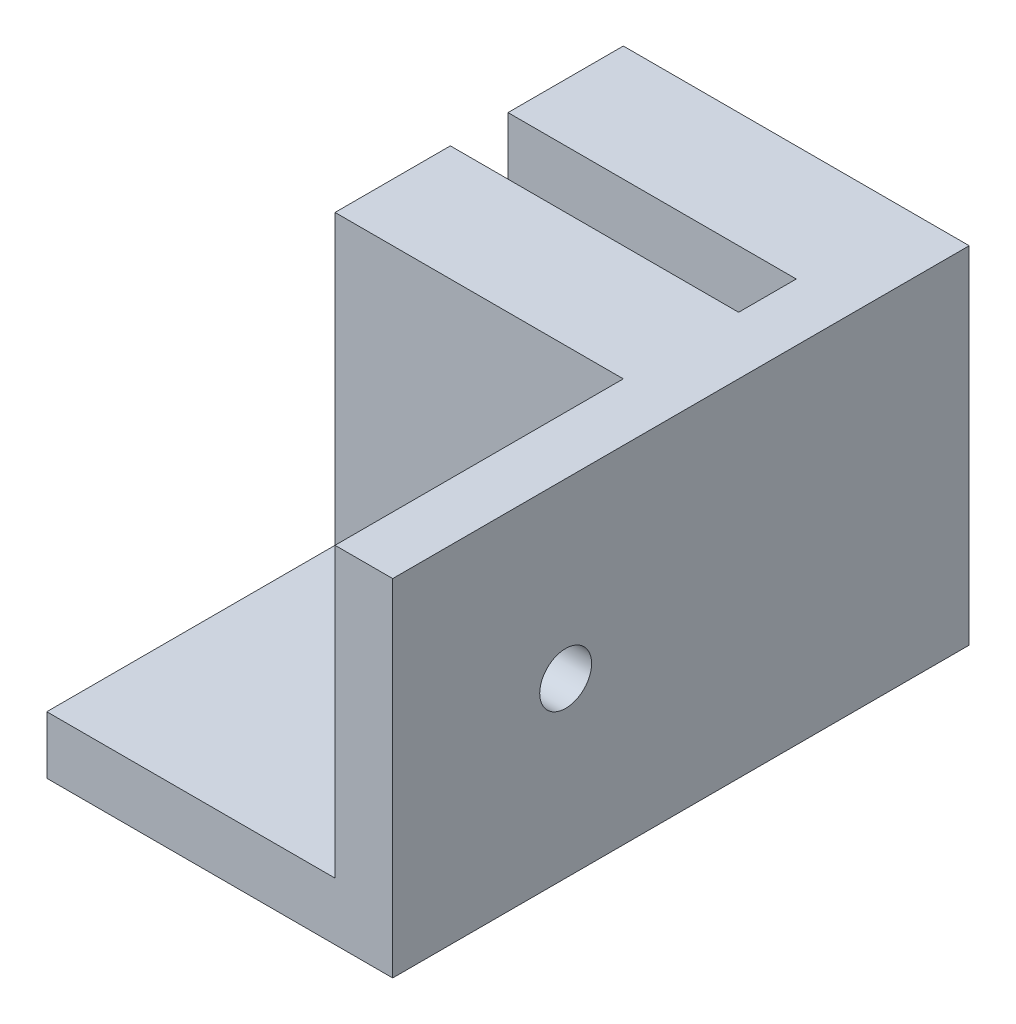
ISO-10303-21;
HEADER;
FILE_DESCRIPTION(('STEP AP214'),'2;1');
FILE_NAME('part.step','',(''),(''),'','','');
FILE_SCHEMA(('AUTOMOTIVE_DESIGN { 1 0 10303 214 1 1 1 1 }'));
ENDSEC;
DATA;
#1=APPLICATION_CONTEXT('core data for automotive mechanical design processes');
#2=APPLICATION_PROTOCOL_DEFINITION('international standard','automotive_design',2000,#1);
#3=PRODUCT_CONTEXT('',#1,'mechanical');
#4=PRODUCT('Part','Part','',(#3));
#5=PRODUCT_RELATED_PRODUCT_CATEGORY('part','',(#4));
#6=PRODUCT_DEFINITION_FORMATION('','',#4);
#7=PRODUCT_DEFINITION_CONTEXT('part definition',#1,'design');
#8=PRODUCT_DEFINITION('design','',#6,#7);
#9=PRODUCT_DEFINITION_SHAPE('','',#8);
#10=(LENGTH_UNIT() NAMED_UNIT(*) SI_UNIT(.MILLI.,.METRE.));
#11=(NAMED_UNIT(*) PLANE_ANGLE_UNIT() SI_UNIT($,.RADIAN.));
#12=(NAMED_UNIT(*) SI_UNIT($,.STERADIAN.) SOLID_ANGLE_UNIT());
#13=UNCERTAINTY_MEASURE_WITH_UNIT(LENGTH_MEASURE(1.E-05),#10,'distance_accuracy_value','');
#14=(GEOMETRIC_REPRESENTATION_CONTEXT(3) GLOBAL_UNCERTAINTY_ASSIGNED_CONTEXT((#13)) GLOBAL_UNIT_ASSIGNED_CONTEXT((#10,
#11,#12)) REPRESENTATION_CONTEXT('',''));
#15=CARTESIAN_POINT('',(0.,0.,0.));
#16=DIRECTION('',(0.,0.,1.));
#17=DIRECTION('',(1.,0.,0.));
#18=AXIS2_PLACEMENT_3D('',#15,#16,#17);
#19=CARTESIAN_POINT('',(-30.,0.,50.));
#20=DIRECTION('',(1.,0.,0.));
#21=DIRECTION('',(0.,0.,-1.));
#22=AXIS2_PLACEMENT_3D('',#19,#20,#21);
#23=PLANE('',#22);
#24=DIRECTION('',(0.,0.,-1.));
#25=VECTOR('',#24,1.);
#26=CARTESIAN_POINT('',(-30.,0.,50.));
#27=LINE('',#26,#25);
#28=CARTESIAN_POINT('',(-30.,0.,10.));
#29=VERTEX_POINT('',#28);
#30=CARTESIAN_POINT('',(-30.,0.,0.));
#31=VERTEX_POINT('',#30);
#32=EDGE_CURVE('E202',#29,#31,#27,.T.);
#33=ORIENTED_EDGE('',*,*,#32,.F.);
#34=DIRECTION('',(0.,1.,0.));
#35=VECTOR('',#34,1.);
#36=CARTESIAN_POINT('',(-30.,0.,10.));
#37=LINE('',#36,#35);
#38=CARTESIAN_POINT('',(-30.,30.,10.));
#39=VERTEX_POINT('',#38);
#40=EDGE_CURVE('E169',#29,#39,#37,.T.);
#41=ORIENTED_EDGE('',*,*,#40,.T.);
#42=DIRECTION('',(0.,0.,-1.));
#43=VECTOR('',#42,1.);
#44=CARTESIAN_POINT('',(-30.,30.,50.));
#45=LINE('',#44,#43);
#46=CARTESIAN_POINT('',(-30.,30.,0.));
#47=VERTEX_POINT('',#46);
#48=EDGE_CURVE('E205',#39,#47,#45,.T.);
#49=ORIENTED_EDGE('',*,*,#48,.T.);
#50=DIRECTION('',(0.,-1.,0.));
#51=VECTOR('',#50,1.);
#52=CARTESIAN_POINT('',(-30.,0.,0.));
#53=LINE('',#52,#51);
#54=EDGE_CURVE('E196',#47,#31,#53,.T.);
#55=ORIENTED_EDGE('',*,*,#54,.T.);
#56=EDGE_LOOP('',(#33,#41,#49,#55));
#57=FACE_BOUND('',#56,.T.);
#58=ADVANCED_FACE('F38',(#57),#23,.F.);
#59=CARTESIAN_POINT('',(0.,0.,50.));
#60=DIRECTION('',(-1.,0.,0.));
#61=DIRECTION('',(0.,0.,1.));
#62=AXIS2_PLACEMENT_3D('',#59,#60,#61);
#63=PLANE('',#62);
#64=CARTESIAN_POINT('',(0.,15.,35.));
#65=DIRECTION('',(-1.,0.,0.));
#66=DIRECTION('',(0.,0.,1.));
#67=AXIS2_PLACEMENT_3D('',#64,#65,#66);
#68=CIRCLE('',#67,2.25);
#69=CARTESIAN_POINT('',(0.,15.,37.25));
#70=VERTEX_POINT('',#69);
#71=EDGE_CURVE('E144',#70,#70,#68,.T.);
#72=ORIENTED_EDGE('',*,*,#71,.T.);
#73=EDGE_LOOP('',(#72));
#74=FACE_BOUND('',#73,.T.);
#75=DIRECTION('',(0.,1.,0.));
#76=VECTOR('',#75,1.);
#77=CARTESIAN_POINT('',(0.,0.,0.));
#78=LINE('',#77,#76);
#79=CARTESIAN_POINT('',(0.,0.,0.));
#80=VERTEX_POINT('',#79);
#81=CARTESIAN_POINT('',(0.,30.,0.));
#82=VERTEX_POINT('',#81);
#83=EDGE_CURVE('E172',#80,#82,#78,.T.);
#84=ORIENTED_EDGE('',*,*,#83,.T.);
#85=DIRECTION('',(0.,0.,-1.));
#86=VECTOR('',#85,1.);
#87=CARTESIAN_POINT('',(0.,30.,50.));
#88=LINE('',#87,#86);
#89=CARTESIAN_POINT('',(0.,30.,50.));
#90=VERTEX_POINT('',#89);
#91=EDGE_CURVE('E11',#90,#82,#88,.T.);
#92=ORIENTED_EDGE('',*,*,#91,.F.);
#93=DIRECTION('',(0.,1.,0.));
#94=VECTOR('',#93,1.);
#95=CARTESIAN_POINT('',(0.,0.,50.));
#96=LINE('',#95,#94);
#97=CARTESIAN_POINT('',(0.,0.,50.));
#98=VERTEX_POINT('',#97);
#99=EDGE_CURVE('E179',#98,#90,#96,.T.);
#100=ORIENTED_EDGE('',*,*,#99,.F.);
#101=DIRECTION('',(0.,0.,-1.));
#102=VECTOR('',#101,1.);
#103=CARTESIAN_POINT('',(0.,0.,50.));
#104=LINE('',#103,#102);
#105=EDGE_CURVE('E190',#98,#80,#104,.T.);
#106=ORIENTED_EDGE('',*,*,#105,.T.);
#107=EDGE_LOOP('',(#84,#92,#100,#106));
#108=FACE_BOUND('',#107,.T.);
#109=ADVANCED_FACE('F40',(#74,#108),#63,.F.);
#110=CARTESIAN_POINT('',(0.,30.,50.));
#111=DIRECTION('',(0.,-1.,0.));
#112=DIRECTION('',(1.,0.,0.));
#113=AXIS2_PLACEMENT_3D('',#110,#111,#112);
#114=PLANE('',#113);
#115=DIRECTION('',(-1.,0.,0.));
#116=VECTOR('',#115,1.);
#117=CARTESIAN_POINT('',(-5.,30.,25.));
#118=LINE('',#117,#116);
#119=CARTESIAN_POINT('',(-5.,30.,25.));
#120=VERTEX_POINT('',#119);
#121=CARTESIAN_POINT('',(-30.,30.,25.));
#122=VERTEX_POINT('',#121);
#123=EDGE_CURVE('E140',#120,#122,#118,.T.);
#124=ORIENTED_EDGE('',*,*,#123,.F.);
#125=DIRECTION('',(0.,0.,-1.));
#126=VECTOR('',#125,1.);
#127=CARTESIAN_POINT('',(-5.,30.,25.));
#128=LINE('',#127,#126);
#129=CARTESIAN_POINT('',(-5.,30.,50.));
#130=VERTEX_POINT('',#129);
#131=EDGE_CURVE('E128',#130,#120,#128,.T.);
#132=ORIENTED_EDGE('',*,*,#131,.F.);
#133=DIRECTION('',(-1.,0.,0.));
#134=VECTOR('',#133,1.);
#135=CARTESIAN_POINT('',(0.,30.,50.));
#136=LINE('',#135,#134);
#137=EDGE_CURVE('E182',#90,#130,#136,.T.);
#138=ORIENTED_EDGE('',*,*,#137,.F.);
#139=ORIENTED_EDGE('',*,*,#91,.T.);
#140=DIRECTION('',(-1.,0.,0.));
#141=VECTOR('',#140,1.);
#142=CARTESIAN_POINT('',(0.,30.,0.));
#143=LINE('',#142,#141);
#144=EDGE_CURVE('E193',#82,#47,#143,.T.);
#145=ORIENTED_EDGE('',*,*,#144,.T.);
#146=ORIENTED_EDGE('',*,*,#48,.F.);
#147=DIRECTION('',(-1.,0.,0.));
#148=VECTOR('',#147,1.);
#149=CARTESIAN_POINT('',(-30.,30.,10.));
#150=LINE('',#149,#148);
#151=CARTESIAN_POINT('',(-5.,30.,10.));
#152=VERTEX_POINT('',#151);
#153=EDGE_CURVE('E157',#152,#39,#150,.T.);
#154=ORIENTED_EDGE('',*,*,#153,.F.);
#155=DIRECTION('',(0.,0.,-1.));
#156=VECTOR('',#155,1.);
#157=CARTESIAN_POINT('',(-5.,30.,10.));
#158=LINE('',#157,#156);
#159=CARTESIAN_POINT('',(-5.,30.,15.));
#160=VERTEX_POINT('',#159);
#161=EDGE_CURVE('E165',#160,#152,#158,.T.);
#162=ORIENTED_EDGE('',*,*,#161,.F.);
#163=DIRECTION('',(1.,0.,0.));
#164=VECTOR('',#163,1.);
#165=CARTESIAN_POINT('',(-30.,30.,15.));
#166=LINE('',#165,#164);
#167=CARTESIAN_POINT('',(-30.,30.,15.));
#168=VERTEX_POINT('',#167);
#169=EDGE_CURVE('E152',#168,#160,#166,.T.);
#170=ORIENTED_EDGE('',*,*,#169,.F.);
#171=EDGE_CURVE('E46',#122,#168,#45,.T.);
#172=ORIENTED_EDGE('',*,*,#171,.F.);
#173=EDGE_LOOP('',(#124,#132,#138,#139,#145,#146,#154,#162,#170,#172));
#174=FACE_BOUND('',#173,.T.);
#175=ADVANCED_FACE('F216',(#174),#114,.F.);
#176=DIRECTION('',(0.,0.,1.));
#177=VECTOR('',#176,1.);
#178=CARTESIAN_POINT('',(-30.,5.,25.));
#179=LINE('',#178,#177);
#180=CARTESIAN_POINT('',(-30.,5.,25.));
#181=VERTEX_POINT('',#180);
#182=CARTESIAN_POINT('',(-30.,5.,50.));
#183=VERTEX_POINT('',#182);
#184=EDGE_CURVE('E53',#181,#183,#179,.T.);
#185=ORIENTED_EDGE('',*,*,#184,.F.);
#186=DIRECTION('',(0.,1.,0.));
#187=VECTOR('',#186,1.);
#188=CARTESIAN_POINT('',(-30.,5.,25.));
#189=LINE('',#188,#187);
#190=EDGE_CURVE('E131',#181,#122,#189,.T.);
#191=ORIENTED_EDGE('',*,*,#190,.T.);
#192=ORIENTED_EDGE('',*,*,#171,.T.);
#193=DIRECTION('',(0.,1.,0.));
#194=VECTOR('',#193,1.);
#195=CARTESIAN_POINT('',(-30.,0.,15.));
#196=LINE('',#195,#194);
#197=CARTESIAN_POINT('',(-30.,0.,15.));
#198=VERTEX_POINT('',#197);
#199=EDGE_CURVE('E162',#198,#168,#196,.T.);
#200=ORIENTED_EDGE('',*,*,#199,.F.);
#201=CARTESIAN_POINT('',(-30.,0.,50.));
#202=VERTEX_POINT('',#201);
#203=EDGE_CURVE('E203',#202,#198,#27,.T.);
#204=ORIENTED_EDGE('',*,*,#203,.F.);
#205=DIRECTION('',(0.,-1.,0.));
#206=VECTOR('',#205,1.);
#207=CARTESIAN_POINT('',(-30.,0.,50.));
#208=LINE('',#207,#206);
#209=EDGE_CURVE('E186',#183,#202,#208,.T.);
#210=ORIENTED_EDGE('',*,*,#209,.F.);
#211=EDGE_LOOP('',(#185,#191,#192,#200,#204,#210));
#212=FACE_BOUND('',#211,.T.);
#213=ADVANCED_FACE('F231',(#212),#23,.F.);
#214=CARTESIAN_POINT('',(0.,0.,50.));
#215=DIRECTION('',(0.,1.,0.));
#216=DIRECTION('',(-1.,0.,0.));
#217=AXIS2_PLACEMENT_3D('',#214,#215,#216);
#218=PLANE('',#217);
#219=CARTESIAN_POINT('',(-15.,0.,35.));
#220=DIRECTION('',(0.,1.,0.));
#221=DIRECTION('',(0.,0.,1.));
#222=AXIS2_PLACEMENT_3D('',#219,#220,#221);
#223=CIRCLE('',#222,2.25);
#224=CARTESIAN_POINT('',(-15.,0.,37.25));
#225=VERTEX_POINT('',#224);
#226=EDGE_CURVE('E398',#225,#225,#223,.T.);
#227=ORIENTED_EDGE('',*,*,#226,.T.);
#228=EDGE_LOOP('',(#227));
#229=FACE_BOUND('',#228,.T.);
#230=DIRECTION('',(0.,0.,-1.));
#231=VECTOR('',#230,1.);
#232=CARTESIAN_POINT('',(-5.,0.,10.));
#233=LINE('',#232,#231);
#234=CARTESIAN_POINT('',(-5.,0.,15.));
#235=VERTEX_POINT('',#234);
#236=CARTESIAN_POINT('',(-5.,0.,10.));
#237=VERTEX_POINT('',#236);
#238=EDGE_CURVE('E61',#235,#237,#233,.T.);
#239=ORIENTED_EDGE('',*,*,#238,.T.);
#240=DIRECTION('',(-1.,0.,0.));
#241=VECTOR('',#240,1.);
#242=CARTESIAN_POINT('',(-30.,0.,10.));
#243=LINE('',#242,#241);
#244=EDGE_CURVE('E159',#237,#29,#243,.T.);
#245=ORIENTED_EDGE('',*,*,#244,.T.);
#246=ORIENTED_EDGE('',*,*,#32,.T.);
#247=DIRECTION('',(1.,0.,0.));
#248=VECTOR('',#247,1.);
#249=CARTESIAN_POINT('',(0.,0.,0.));
#250=LINE('',#249,#248);
#251=EDGE_CURVE('E183',#31,#80,#250,.T.);
#252=ORIENTED_EDGE('',*,*,#251,.T.);
#253=ORIENTED_EDGE('',*,*,#105,.F.);
#254=DIRECTION('',(1.,0.,0.));
#255=VECTOR('',#254,1.);
#256=CARTESIAN_POINT('',(0.,0.,50.));
#257=LINE('',#256,#255);
#258=EDGE_CURVE('E188',#202,#98,#257,.T.);
#259=ORIENTED_EDGE('',*,*,#258,.F.);
#260=ORIENTED_EDGE('',*,*,#203,.T.);
#261=DIRECTION('',(1.,0.,0.));
#262=VECTOR('',#261,1.);
#263=CARTESIAN_POINT('',(-30.,0.,15.));
#264=LINE('',#263,#262);
#265=EDGE_CURVE('E154',#198,#235,#264,.T.);
#266=ORIENTED_EDGE('',*,*,#265,.T.);
#267=EDGE_LOOP('',(#239,#245,#246,#252,#253,#259,#260,#266));
#268=FACE_BOUND('',#267,.T.);
#269=ADVANCED_FACE('F223',(#229,#268),#218,.F.);
#270=CARTESIAN_POINT('',(0.,0.,50.));
#271=DIRECTION('',(0.,0.,1.));
#272=DIRECTION('',(1.,0.,0.));
#273=AXIS2_PLACEMENT_3D('',#270,#271,#272);
#274=PLANE('',#273);
#275=DIRECTION('',(0.,1.,0.));
#276=VECTOR('',#275,1.);
#277=CARTESIAN_POINT('',(-5.,5.,50.));
#278=LINE('',#277,#276);
#279=CARTESIAN_POINT('',(-5.,5.,50.));
#280=VERTEX_POINT('',#279);
#281=EDGE_CURVE('E150',#280,#130,#278,.T.);
#282=ORIENTED_EDGE('',*,*,#281,.F.);
#283=DIRECTION('',(1.,0.,0.));
#284=VECTOR('',#283,1.);
#285=CARTESIAN_POINT('',(-5.,5.,50.));
#286=LINE('',#285,#284);
#287=EDGE_CURVE('E132',#183,#280,#286,.T.);
#288=ORIENTED_EDGE('',*,*,#287,.F.);
#289=ORIENTED_EDGE('',*,*,#209,.T.);
#290=ORIENTED_EDGE('',*,*,#258,.T.);
#291=ORIENTED_EDGE('',*,*,#99,.T.);
#292=ORIENTED_EDGE('',*,*,#137,.T.);
#293=EDGE_LOOP('',(#282,#288,#289,#290,#291,#292));
#294=FACE_BOUND('',#293,.T.);
#295=ADVANCED_FACE('F228',(#294),#274,.T.);
#296=CARTESIAN_POINT('',(0.,0.,0.));
#297=DIRECTION('',(0.,0.,1.));
#298=DIRECTION('',(1.,0.,0.));
#299=AXIS2_PLACEMENT_3D('',#296,#297,#298);
#300=PLANE('',#299);
#301=ORIENTED_EDGE('',*,*,#83,.F.);
#302=ORIENTED_EDGE('',*,*,#251,.F.);
#303=ORIENTED_EDGE('',*,*,#54,.F.);
#304=ORIENTED_EDGE('',*,*,#144,.F.);
#305=EDGE_LOOP('',(#301,#302,#303,#304));
#306=FACE_BOUND('',#305,.T.);
#307=ADVANCED_FACE('F220',(#306),#300,.F.);
#308=CARTESIAN_POINT('',(-30.,0.,10.));
#309=DIRECTION('',(0.,0.,-1.));
#310=DIRECTION('',(-1.,0.,0.));
#311=AXIS2_PLACEMENT_3D('',#308,#309,#310);
#312=PLANE('',#311);
#313=ORIENTED_EDGE('',*,*,#153,.T.);
#314=ORIENTED_EDGE('',*,*,#40,.F.);
#315=ORIENTED_EDGE('',*,*,#244,.F.);
#316=DIRECTION('',(0.,1.,0.));
#317=VECTOR('',#316,1.);
#318=CARTESIAN_POINT('',(-5.,0.,10.));
#319=LINE('',#318,#317);
#320=EDGE_CURVE('E173',#237,#152,#319,.T.);
#321=ORIENTED_EDGE('',*,*,#320,.T.);
#322=EDGE_LOOP('',(#313,#314,#315,#321));
#323=FACE_BOUND('',#322,.T.);
#324=ADVANCED_FACE('F239',(#323),#312,.F.);
#325=CARTESIAN_POINT('',(-5.,0.,10.));
#326=DIRECTION('',(1.,0.,0.));
#327=DIRECTION('',(0.,0.,-1.));
#328=AXIS2_PLACEMENT_3D('',#325,#326,#327);
#329=PLANE('',#328);
#330=ORIENTED_EDGE('',*,*,#161,.T.);
#331=ORIENTED_EDGE('',*,*,#320,.F.);
#332=ORIENTED_EDGE('',*,*,#238,.F.);
#333=DIRECTION('',(0.,1.,0.));
#334=VECTOR('',#333,1.);
#335=CARTESIAN_POINT('',(-5.,0.,15.));
#336=LINE('',#335,#334);
#337=EDGE_CURVE('E175',#235,#160,#336,.T.);
#338=ORIENTED_EDGE('',*,*,#337,.T.);
#339=EDGE_LOOP('',(#330,#331,#332,#338));
#340=FACE_BOUND('',#339,.T.);
#341=ADVANCED_FACE('F236',(#340),#329,.F.);
#342=CARTESIAN_POINT('',(-30.,0.,15.));
#343=DIRECTION('',(0.,0.,1.));
#344=DIRECTION('',(1.,0.,0.));
#345=AXIS2_PLACEMENT_3D('',#342,#343,#344);
#346=PLANE('',#345);
#347=ORIENTED_EDGE('',*,*,#169,.T.);
#348=ORIENTED_EDGE('',*,*,#337,.F.);
#349=ORIENTED_EDGE('',*,*,#265,.F.);
#350=ORIENTED_EDGE('',*,*,#199,.T.);
#351=EDGE_LOOP('',(#347,#348,#349,#350));
#352=FACE_BOUND('',#351,.T.);
#353=ADVANCED_FACE('F234',(#352),#346,.F.);
#354=CARTESIAN_POINT('',(-5.,5.,25.));
#355=DIRECTION('',(1.,0.,0.));
#356=DIRECTION('',(0.,0.,-1.));
#357=AXIS2_PLACEMENT_3D('',#354,#355,#356);
#358=PLANE('',#357);
#359=CARTESIAN_POINT('',(-5.,15.,35.));
#360=DIRECTION('',(-1.,0.,0.));
#361=DIRECTION('',(0.,0.,1.));
#362=AXIS2_PLACEMENT_3D('',#359,#360,#361);
#363=CIRCLE('',#362,2.24999999999999);
#364=CARTESIAN_POINT('',(-5.,15.,37.25));
#365=VERTEX_POINT('',#364);
#366=EDGE_CURVE('E403',#365,#365,#363,.T.);
#367=ORIENTED_EDGE('',*,*,#366,.F.);
#368=EDGE_LOOP('',(#367));
#369=FACE_BOUND('',#368,.T.);
#370=ORIENTED_EDGE('',*,*,#131,.T.);
#371=DIRECTION('',(0.,1.,0.));
#372=VECTOR('',#371,1.);
#373=CARTESIAN_POINT('',(-5.,5.,25.));
#374=LINE('',#373,#372);
#375=CARTESIAN_POINT('',(-5.,5.,25.));
#376=VERTEX_POINT('',#375);
#377=EDGE_CURVE('E122',#376,#120,#374,.T.);
#378=ORIENTED_EDGE('',*,*,#377,.F.);
#379=DIRECTION('',(0.,0.,-1.));
#380=VECTOR('',#379,1.);
#381=CARTESIAN_POINT('',(-5.,5.,25.));
#382=LINE('',#381,#380);
#383=EDGE_CURVE('E126',#280,#376,#382,.T.);
#384=ORIENTED_EDGE('',*,*,#383,.F.);
#385=ORIENTED_EDGE('',*,*,#281,.T.);
#386=EDGE_LOOP('',(#370,#378,#384,#385));
#387=FACE_BOUND('',#386,.T.);
#388=ADVANCED_FACE('F124',(#369,#387),#358,.F.);
#389=CARTESIAN_POINT('',(-5.,5.,25.));
#390=DIRECTION('',(0.,0.,-1.));
#391=DIRECTION('',(-1.,0.,0.));
#392=AXIS2_PLACEMENT_3D('',#389,#390,#391);
#393=PLANE('',#392);
#394=ORIENTED_EDGE('',*,*,#123,.T.);
#395=ORIENTED_EDGE('',*,*,#190,.F.);
#396=DIRECTION('',(-1.,0.,0.));
#397=VECTOR('',#396,1.);
#398=CARTESIAN_POINT('',(-5.,5.,25.));
#399=LINE('',#398,#397);
#400=EDGE_CURVE('E134',#376,#181,#399,.T.);
#401=ORIENTED_EDGE('',*,*,#400,.F.);
#402=ORIENTED_EDGE('',*,*,#377,.T.);
#403=EDGE_LOOP('',(#394,#395,#401,#402));
#404=FACE_BOUND('',#403,.T.);
#405=ADVANCED_FACE('F135',(#404),#393,.F.);
#406=CARTESIAN_POINT('',(0.,5.,0.));
#407=DIRECTION('',(0.,-1.,0.));
#408=DIRECTION('',(0.,0.,-1.));
#409=AXIS2_PLACEMENT_3D('',#406,#407,#408);
#410=PLANE('',#409);
#411=CARTESIAN_POINT('',(-15.,5.,35.));
#412=DIRECTION('',(0.,1.,0.));
#413=DIRECTION('',(0.,0.,1.));
#414=AXIS2_PLACEMENT_3D('',#411,#412,#413);
#415=CIRCLE('',#414,2.24999999999999);
#416=CARTESIAN_POINT('',(-15.,5.,37.25));
#417=VERTEX_POINT('',#416);
#418=EDGE_CURVE('E401',#417,#417,#415,.T.);
#419=ORIENTED_EDGE('',*,*,#418,.F.);
#420=EDGE_LOOP('',(#419));
#421=FACE_BOUND('',#420,.T.);
#422=ORIENTED_EDGE('',*,*,#383,.T.);
#423=ORIENTED_EDGE('',*,*,#400,.T.);
#424=ORIENTED_EDGE('',*,*,#184,.T.);
#425=ORIENTED_EDGE('',*,*,#287,.T.);
#426=EDGE_LOOP('',(#422,#423,#424,#425));
#427=FACE_BOUND('',#426,.T.);
#428=ADVANCED_FACE('F138',(#421,#427),#410,.F.);
#429=CARTESIAN_POINT('',(-5.,15.,35.));
#430=DIRECTION('',(-1.,0.,0.));
#431=DIRECTION('',(0.,0.,1.));
#432=AXIS2_PLACEMENT_3D('',#429,#430,#431);
#433=CYLINDRICAL_SURFACE('',#432,2.24999999999999);
#434=ORIENTED_EDGE('',*,*,#71,.F.);
#435=EDGE_LOOP('',(#434));
#436=FACE_BOUND('',#435,.T.);
#437=ORIENTED_EDGE('',*,*,#366,.T.);
#438=EDGE_LOOP('',(#437));
#439=FACE_BOUND('',#438,.T.);
#440=ADVANCED_FACE('F305',(#436,#439),#433,.F.);
#441=CARTESIAN_POINT('',(-15.,5.,35.));
#442=DIRECTION('',(0.,1.,0.));
#443=DIRECTION('',(0.,0.,1.));
#444=AXIS2_PLACEMENT_3D('',#441,#442,#443);
#445=CYLINDRICAL_SURFACE('',#444,2.24999999999999);
#446=ORIENTED_EDGE('',*,*,#226,.F.);
#447=EDGE_LOOP('',(#446));
#448=FACE_BOUND('',#447,.T.);
#449=ORIENTED_EDGE('',*,*,#418,.T.);
#450=EDGE_LOOP('',(#449));
#451=FACE_BOUND('',#450,.T.);
#452=ADVANCED_FACE('F316',(#448,#451),#445,.F.);
#453=CLOSED_SHELL('',(#58,#109,#175,#213,#269,#295,#307,#324,#341,#353,#388,#405,#428,#440,#452));
#454=MANIFOLD_SOLID_BREP('B2',#453);
#455=ADVANCED_BREP_SHAPE_REPRESENTATION('',(#18,#454),#14);
#456=SHAPE_DEFINITION_REPRESENTATION(#9,#455);
ENDSEC;
END-ISO-10303-21;
